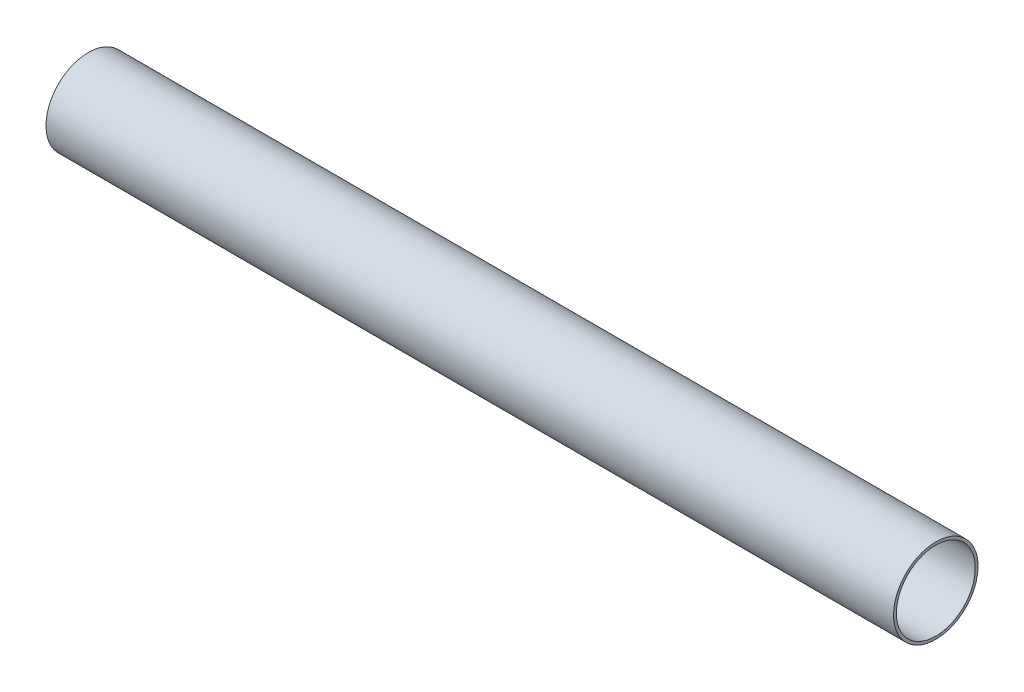
ISO-10303-21;
HEADER;
FILE_DESCRIPTION(('STEP AP214'),'2;1');
FILE_NAME('part.step','',(''),(''),'','','');
FILE_SCHEMA(('AUTOMOTIVE_DESIGN { 1 0 10303 214 1 1 1 1 }'));
ENDSEC;
DATA;
#1=APPLICATION_CONTEXT('core data for automotive mechanical design processes');
#2=APPLICATION_PROTOCOL_DEFINITION('international standard','automotive_design',2000,#1);
#3=PRODUCT_CONTEXT('',#1,'mechanical');
#4=PRODUCT('Part','Part','',(#3));
#5=PRODUCT_RELATED_PRODUCT_CATEGORY('part','',(#4));
#6=PRODUCT_DEFINITION_FORMATION('','',#4);
#7=PRODUCT_DEFINITION_CONTEXT('part definition',#1,'design');
#8=PRODUCT_DEFINITION('design','',#6,#7);
#9=PRODUCT_DEFINITION_SHAPE('','',#8);
#10=(LENGTH_UNIT() NAMED_UNIT(*) SI_UNIT(.MILLI.,.METRE.));
#11=(NAMED_UNIT(*) PLANE_ANGLE_UNIT() SI_UNIT($,.RADIAN.));
#12=(NAMED_UNIT(*) SI_UNIT($,.STERADIAN.) SOLID_ANGLE_UNIT());
#13=UNCERTAINTY_MEASURE_WITH_UNIT(LENGTH_MEASURE(1.E-05),#10,'distance_accuracy_value','');
#14=(GEOMETRIC_REPRESENTATION_CONTEXT(3) GLOBAL_UNCERTAINTY_ASSIGNED_CONTEXT((#13)) GLOBAL_UNIT_ASSIGNED_CONTEXT((#10,
#11,#12)) REPRESENTATION_CONTEXT('',''));
#15=CARTESIAN_POINT('',(0.,0.,0.));
#16=DIRECTION('',(0.,0.,1.));
#17=DIRECTION('',(1.,0.,0.));
#18=AXIS2_PLACEMENT_3D('',#15,#16,#17);
#19=CARTESIAN_POINT('',(-34220.2160646753,-17152.2927937246,39207.3639318628));
#20=DIRECTION('',(-1.,0.,0.));
#21=DIRECTION('',(0.,0.,1.));
#22=AXIS2_PLACEMENT_3D('',#19,#20,#21);
#23=PLANE('',#22);
#24=CARTESIAN_POINT('',(-34220.2160646753,-17152.2927937246,39207.3639318628));
#25=DIRECTION('',(-1.,0.,0.));
#26=DIRECTION('',(0.,0.,1.));
#27=AXIS2_PLACEMENT_3D('',#24,#25,#26);
#28=CIRCLE('',#27,14.0000000000006);
#29=CARTESIAN_POINT('',(-34220.2160646753,-17152.2927937246,39221.3639318628));
#30=VERTEX_POINT('',#29);
#31=EDGE_CURVE('E55',#30,#30,#28,.T.);
#32=ORIENTED_EDGE('',*,*,#31,.T.);
#33=EDGE_LOOP('',(#32));
#34=FACE_BOUND('',#33,.T.);
#35=CARTESIAN_POINT('',(-34220.2160646753,-17152.2927937246,39207.3639318628));
#36=DIRECTION('',(-1.,0.,0.));
#37=DIRECTION('',(0.,0.,1.));
#38=AXIS2_PLACEMENT_3D('',#35,#36,#37);
#39=CIRCLE('',#38,15.0000000000006);
#40=CARTESIAN_POINT('',(-34220.2160646753,-17152.2927937246,39222.3639318628));
#41=VERTEX_POINT('',#40);
#42=EDGE_CURVE('E47',#41,#41,#39,.T.);
#43=ORIENTED_EDGE('',*,*,#42,.F.);
#44=EDGE_LOOP('',(#43));
#45=FACE_BOUND('',#44,.T.);
#46=ADVANCED_FACE('F41',(#34,#45),#23,.F.);
#47=CARTESIAN_POINT('',(-34520.9763164532,-17152.2927937246,39207.3639318628));
#48=DIRECTION('',(-1.,0.,0.));
#49=DIRECTION('',(0.,0.,1.));
#50=AXIS2_PLACEMENT_3D('',#47,#48,#49);
#51=PLANE('',#50);
#52=CARTESIAN_POINT('',(-34520.9763164532,-17152.2927937246,39207.3639318628));
#53=DIRECTION('',(-1.,0.,0.));
#54=DIRECTION('',(0.,0.,1.));
#55=AXIS2_PLACEMENT_3D('',#52,#53,#54);
#56=CIRCLE('',#55,14.0000000000006);
#57=CARTESIAN_POINT('',(-34520.9763164532,-17152.2927937246,39221.3639318628));
#58=VERTEX_POINT('',#57);
#59=EDGE_CURVE('E51',#58,#58,#56,.T.);
#60=ORIENTED_EDGE('',*,*,#59,.F.);
#61=EDGE_LOOP('',(#60));
#62=FACE_BOUND('',#61,.T.);
#63=CARTESIAN_POINT('',(-34520.9763164532,-17152.2927937246,39207.3639318628));
#64=DIRECTION('',(-1.,0.,0.));
#65=DIRECTION('',(0.,0.,1.));
#66=AXIS2_PLACEMENT_3D('',#63,#64,#65);
#67=CIRCLE('',#66,15.0000000000006);
#68=CARTESIAN_POINT('',(-34520.9763164532,-17152.2927937246,39222.3639318628));
#69=VERTEX_POINT('',#68);
#70=EDGE_CURVE('E11',#69,#69,#67,.T.);
#71=ORIENTED_EDGE('',*,*,#70,.T.);
#72=EDGE_LOOP('',(#71));
#73=FACE_BOUND('',#72,.T.);
#74=ADVANCED_FACE('F71',(#62,#73),#51,.T.);
#75=CARTESIAN_POINT('',(-34220.2160646753,-17152.2927937246,39207.3639318628));
#76=DIRECTION('',(-1.,0.,0.));
#77=DIRECTION('',(0.,0.,1.));
#78=AXIS2_PLACEMENT_3D('',#75,#76,#77);
#79=CYLINDRICAL_SURFACE('',#78,15.0000000000006);
#80=ORIENTED_EDGE('',*,*,#70,.F.);
#81=EDGE_LOOP('',(#80));
#82=FACE_BOUND('',#81,.T.);
#83=ORIENTED_EDGE('',*,*,#42,.T.);
#84=EDGE_LOOP('',(#83));
#85=FACE_BOUND('',#84,.T.);
#86=ADVANCED_FACE('F65',(#82,#85),#79,.T.);
#87=CARTESIAN_POINT('',(-34220.2160646753,-17152.2927937246,39207.3639318628));
#88=DIRECTION('',(-1.,0.,0.));
#89=DIRECTION('',(0.,0.,1.));
#90=AXIS2_PLACEMENT_3D('',#87,#88,#89);
#91=CYLINDRICAL_SURFACE('',#90,14.0000000000006);
#92=ORIENTED_EDGE('',*,*,#59,.T.);
#93=EDGE_LOOP('',(#92));
#94=FACE_BOUND('',#93,.T.);
#95=ORIENTED_EDGE('',*,*,#31,.F.);
#96=EDGE_LOOP('',(#95));
#97=FACE_BOUND('',#96,.T.);
#98=ADVANCED_FACE('F63',(#94,#97),#91,.F.);
#99=CLOSED_SHELL('',(#46,#74,#86,#98));
#100=MANIFOLD_SOLID_BREP('B2',#99);
#101=ADVANCED_BREP_SHAPE_REPRESENTATION('',(#18,#100),#14);
#102=SHAPE_DEFINITION_REPRESENTATION(#9,#101);
ENDSEC;
END-ISO-10303-21;
